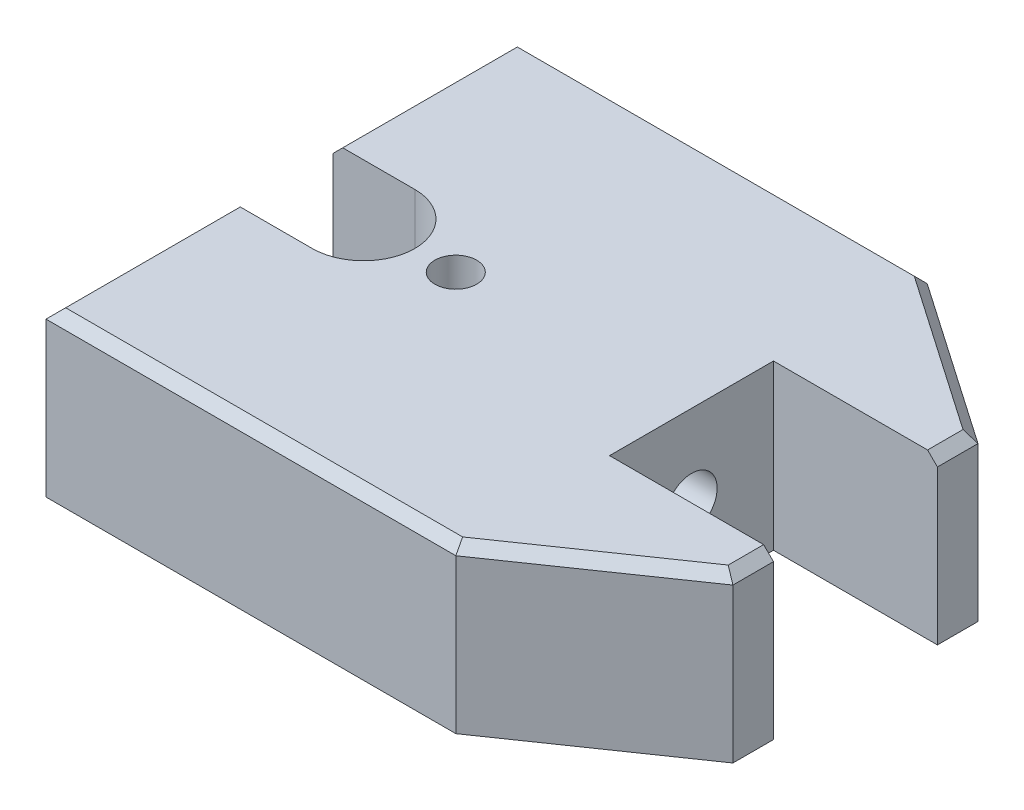
ISO-10303-21;
HEADER;
FILE_DESCRIPTION(('STEP AP214'),'2;1');
FILE_NAME('part.step','',(''),(''),'','','');
FILE_SCHEMA(('AUTOMOTIVE_DESIGN { 1 0 10303 214 1 1 1 1 }'));
ENDSEC;
DATA;
#1=APPLICATION_CONTEXT('core data for automotive mechanical design processes');
#2=APPLICATION_PROTOCOL_DEFINITION('international standard','automotive_design',2000,#1);
#3=PRODUCT_CONTEXT('',#1,'mechanical');
#4=PRODUCT('Part','Part','',(#3));
#5=PRODUCT_RELATED_PRODUCT_CATEGORY('part','',(#4));
#6=PRODUCT_DEFINITION_FORMATION('','',#4);
#7=PRODUCT_DEFINITION_CONTEXT('part definition',#1,'design');
#8=PRODUCT_DEFINITION('design','',#6,#7);
#9=PRODUCT_DEFINITION_SHAPE('','',#8);
#10=(LENGTH_UNIT() NAMED_UNIT(*) SI_UNIT(.MILLI.,.METRE.));
#11=(NAMED_UNIT(*) PLANE_ANGLE_UNIT() SI_UNIT($,.RADIAN.));
#12=(NAMED_UNIT(*) SI_UNIT($,.STERADIAN.) SOLID_ANGLE_UNIT());
#13=UNCERTAINTY_MEASURE_WITH_UNIT(LENGTH_MEASURE(1.E-05),#10,'distance_accuracy_value','');
#14=(GEOMETRIC_REPRESENTATION_CONTEXT(3) GLOBAL_UNCERTAINTY_ASSIGNED_CONTEXT((#13)) GLOBAL_UNIT_ASSIGNED_CONTEXT((#10,
#11,#12)) REPRESENTATION_CONTEXT('',''));
#15=CARTESIAN_POINT('',(0.,0.,0.));
#16=DIRECTION('',(0.,0.,1.));
#17=DIRECTION('',(1.,0.,0.));
#18=AXIS2_PLACEMENT_3D('',#15,#16,#17);
#19=CARTESIAN_POINT('',(0.,12.7,-36.5125));
#20=DIRECTION('',(1.,0.,0.));
#21=DIRECTION('',(0.,0.,-1.));
#22=AXIS2_PLACEMENT_3D('',#19,#20,#21);
#23=PLANE('',#22);
#24=DIRECTION('',(0.,1.,0.));
#25=VECTOR('',#24,1.);
#26=CARTESIAN_POINT('',(0.,-12.7,-7.9375));
#27=LINE('',#26,#25);
#28=CARTESIAN_POINT('',(0.,-12.7,-7.9375));
#29=VERTEX_POINT('',#28);
#30=CARTESIAN_POINT('',(0.,11.176,-7.9375));
#31=VERTEX_POINT('',#30);
#32=EDGE_CURVE('E229',#29,#31,#27,.T.);
#33=ORIENTED_EDGE('',*,*,#32,.T.);
#34=DIRECTION('',(0.,0.,-1.));
#35=VECTOR('',#34,1.);
#36=CARTESIAN_POINT('',(0.,11.176,-36.5125));
#37=LINE('',#36,#35);
#38=CARTESIAN_POINT('',(0.,11.176,-36.5125));
#39=VERTEX_POINT('',#38);
#40=EDGE_CURVE('E318',#31,#39,#37,.T.);
#41=ORIENTED_EDGE('',*,*,#40,.T.);
#42=DIRECTION('',(0.,-1.,0.));
#43=VECTOR('',#42,1.);
#44=CARTESIAN_POINT('',(0.,12.7,-36.5125));
#45=LINE('',#44,#43);
#46=CARTESIAN_POINT('',(0.,-12.7,-36.5125));
#47=VERTEX_POINT('',#46);
#48=EDGE_CURVE('E296',#39,#47,#45,.T.);
#49=ORIENTED_EDGE('',*,*,#48,.T.);
#50=DIRECTION('',(0.,0.,1.));
#51=VECTOR('',#50,1.);
#52=CARTESIAN_POINT('',(0.,-12.7,-36.5125));
#53=LINE('',#52,#51);
#54=EDGE_CURVE('E270',#47,#29,#53,.T.);
#55=ORIENTED_EDGE('',*,*,#54,.T.);
#56=EDGE_LOOP('',(#33,#41,#49,#55));
#57=FACE_BOUND('',#56,.T.);
#58=ADVANCED_FACE('F55',(#57),#23,.F.);
#59=CARTESIAN_POINT('',(88.9,12.7,18.9865));
#60=DIRECTION('',(-1.,0.,0.));
#61=DIRECTION('',(0.,0.,1.));
#62=AXIS2_PLACEMENT_3D('',#59,#60,#61);
#63=PLANE('',#62);
#64=DIRECTION('',(0.,1.,0.));
#65=VECTOR('',#64,1.);
#66=CARTESIAN_POINT('',(88.9,-12.7,12.7));
#67=LINE('',#66,#65);
#68=CARTESIAN_POINT('',(88.9,-12.7,12.7));
#69=VERTEX_POINT('',#68);
#70=CARTESIAN_POINT('',(88.9,11.176,12.7));
#71=VERTEX_POINT('',#70);
#72=EDGE_CURVE('E256',#69,#71,#67,.T.);
#73=ORIENTED_EDGE('',*,*,#72,.T.);
#74=DIRECTION('',(0.,0.,1.));
#75=VECTOR('',#74,1.);
#76=CARTESIAN_POINT('',(88.9,11.176,18.9865));
#77=LINE('',#76,#75);
#78=CARTESIAN_POINT('',(88.9,11.176,18.9865));
#79=VERTEX_POINT('',#78);
#80=EDGE_CURVE('E330',#71,#79,#77,.T.);
#81=ORIENTED_EDGE('',*,*,#80,.T.);
#82=DIRECTION('',(0.,-1.,0.));
#83=VECTOR('',#82,1.);
#84=CARTESIAN_POINT('',(88.9,12.7,18.9865));
#85=LINE('',#84,#83);
#86=CARTESIAN_POINT('',(88.9,-12.7,18.9865));
#87=VERTEX_POINT('',#86);
#88=EDGE_CURVE('E290',#79,#87,#85,.T.);
#89=ORIENTED_EDGE('',*,*,#88,.T.);
#90=DIRECTION('',(0.,0.,-1.));
#91=VECTOR('',#90,1.);
#92=CARTESIAN_POINT('',(88.9,-12.7,18.9865));
#93=LINE('',#92,#91);
#94=EDGE_CURVE('E280',#87,#69,#93,.T.);
#95=ORIENTED_EDGE('',*,*,#94,.T.);
#96=EDGE_LOOP('',(#73,#81,#89,#95));
#97=FACE_BOUND('',#96,.T.);
#98=ADVANCED_FACE('F449',(#97),#63,.F.);
#99=CARTESIAN_POINT('',(0.,12.7,-36.5125));
#100=DIRECTION('',(0.,0.,1.));
#101=DIRECTION('',(1.,0.,0.));
#102=AXIS2_PLACEMENT_3D('',#99,#100,#101);
#103=PLANE('',#102);
#104=ORIENTED_EDGE('',*,*,#48,.F.);
#105=DIRECTION('',(1.,0.,0.));
#106=VECTOR('',#105,1.);
#107=CARTESIAN_POINT('',(63.5,11.176,-36.5125));
#108=LINE('',#107,#106);
#109=CARTESIAN_POINT('',(63.5,11.176,-36.5125));
#110=VERTEX_POINT('',#109);
#111=EDGE_CURVE('E320',#39,#110,#108,.T.);
#112=ORIENTED_EDGE('',*,*,#111,.T.);
#113=DIRECTION('',(0.,-1.,0.));
#114=VECTOR('',#113,1.);
#115=CARTESIAN_POINT('',(63.5,12.7,-36.5125));
#116=LINE('',#115,#114);
#117=CARTESIAN_POINT('',(63.5,-12.7,-36.5125));
#118=VERTEX_POINT('',#117);
#119=EDGE_CURVE('E286',#110,#118,#116,.T.);
#120=ORIENTED_EDGE('',*,*,#119,.T.);
#121=DIRECTION('',(-1.,0.,0.));
#122=VECTOR('',#121,1.);
#123=CARTESIAN_POINT('',(0.,-12.7,-36.5125));
#124=LINE('',#123,#122);
#125=EDGE_CURVE('E259',#118,#47,#124,.T.);
#126=ORIENTED_EDGE('',*,*,#125,.T.);
#127=EDGE_LOOP('',(#104,#112,#120,#126));
#128=FACE_BOUND('',#127,.T.);
#129=ADVANCED_FACE('F427',(#128),#103,.F.);
#130=DIRECTION('',(0.,-1.,0.));
#131=VECTOR('',#130,1.);
#132=CARTESIAN_POINT('',(0.,12.7,36.5125));
#133=LINE('',#132,#131);
#134=CARTESIAN_POINT('',(0.,11.176,36.5125));
#135=VERTEX_POINT('',#134);
#136=CARTESIAN_POINT('',(0.,-12.7,36.5125));
#137=VERTEX_POINT('',#136);
#138=EDGE_CURVE('E294',#135,#137,#133,.T.);
#139=ORIENTED_EDGE('',*,*,#138,.F.);
#140=DIRECTION('',(0.,0.,-1.));
#141=VECTOR('',#140,1.);
#142=CARTESIAN_POINT('',(0.,11.176,7.9375));
#143=LINE('',#142,#141);
#144=CARTESIAN_POINT('',(0.,11.176,7.9375));
#145=VERTEX_POINT('',#144);
#146=EDGE_CURVE('E64',#135,#145,#143,.T.);
#147=ORIENTED_EDGE('',*,*,#146,.T.);
#148=DIRECTION('',(0.,1.,0.));
#149=VECTOR('',#148,1.);
#150=CARTESIAN_POINT('',(0.,-12.7,7.9375));
#151=LINE('',#150,#149);
#152=CARTESIAN_POINT('',(0.,-12.7,7.9375));
#153=VERTEX_POINT('',#152);
#154=EDGE_CURVE('E222',#153,#145,#151,.T.);
#155=ORIENTED_EDGE('',*,*,#154,.F.);
#156=EDGE_CURVE('E269',#153,#137,#53,.T.);
#157=ORIENTED_EDGE('',*,*,#156,.T.);
#158=EDGE_LOOP('',(#139,#147,#155,#157));
#159=FACE_BOUND('',#158,.T.);
#160=ADVANCED_FACE('F377',(#159),#23,.F.);
#161=CARTESIAN_POINT('',(0.,12.7,36.5125));
#162=DIRECTION('',(0.,0.,-1.));
#163=DIRECTION('',(-1.,0.,0.));
#164=AXIS2_PLACEMENT_3D('',#161,#162,#163);
#165=PLANE('',#164);
#166=DIRECTION('',(0.,-1.,0.));
#167=VECTOR('',#166,1.);
#168=CARTESIAN_POINT('',(63.5,12.7,36.5125));
#169=LINE('',#168,#167);
#170=CARTESIAN_POINT('',(63.5,11.176,36.5125));
#171=VERTEX_POINT('',#170);
#172=CARTESIAN_POINT('',(63.5,-12.7,36.5125));
#173=VERTEX_POINT('',#172);
#174=EDGE_CURVE('E292',#171,#173,#169,.T.);
#175=ORIENTED_EDGE('',*,*,#174,.F.);
#176=DIRECTION('',(-1.,0.,0.));
#177=VECTOR('',#176,1.);
#178=CARTESIAN_POINT('',(0.,11.176,36.5125));
#179=LINE('',#178,#177);
#180=EDGE_CURVE('E79',#171,#135,#179,.T.);
#181=ORIENTED_EDGE('',*,*,#180,.T.);
#182=ORIENTED_EDGE('',*,*,#138,.T.);
#183=DIRECTION('',(1.,0.,0.));
#184=VECTOR('',#183,1.);
#185=CARTESIAN_POINT('',(0.,-12.7,36.5125));
#186=LINE('',#185,#184);
#187=EDGE_CURVE('E273',#137,#173,#186,.T.);
#188=ORIENTED_EDGE('',*,*,#187,.T.);
#189=EDGE_LOOP('',(#175,#181,#182,#188));
#190=FACE_BOUND('',#189,.T.);
#191=ADVANCED_FACE('F378',(#190),#165,.F.);
#192=CARTESIAN_POINT('',(63.5,12.7,36.5125));
#193=DIRECTION('',(-0.567925279738124,0.,-0.823080115562497));
#194=DIRECTION('',(-0.823080115562497,0.,0.567925279738124));
#195=AXIS2_PLACEMENT_3D('',#192,#193,#194);
#196=PLANE('',#195);
#197=ORIENTED_EDGE('',*,*,#88,.F.);
#198=DIRECTION('',(-0.823080115562497,0.,0.567925279738124));
#199=VECTOR('',#198,1.);
#200=CARTESIAN_POINT('',(63.5,11.176,36.5125));
#201=LINE('',#200,#199);
#202=EDGE_CURVE('E332',#79,#171,#201,.T.);
#203=ORIENTED_EDGE('',*,*,#202,.T.);
#204=ORIENTED_EDGE('',*,*,#174,.T.);
#205=DIRECTION('',(0.823080115562497,0.,-0.567925279738124));
#206=VECTOR('',#205,1.);
#207=CARTESIAN_POINT('',(63.5,-12.7,36.5125));
#208=LINE('',#207,#206);
#209=EDGE_CURVE('E276',#173,#87,#208,.T.);
#210=ORIENTED_EDGE('',*,*,#209,.T.);
#211=EDGE_LOOP('',(#197,#203,#204,#210));
#212=FACE_BOUND('',#211,.T.);
#213=ADVANCED_FACE('F382',(#212),#196,.F.);
#214=DIRECTION('',(0.,-1.,0.));
#215=VECTOR('',#214,1.);
#216=CARTESIAN_POINT('',(88.9,12.7,-18.9865));
#217=LINE('',#216,#215);
#218=CARTESIAN_POINT('',(88.9,11.176,-18.9865));
#219=VERTEX_POINT('',#218);
#220=CARTESIAN_POINT('',(88.9,-12.7,-18.9865));
#221=VERTEX_POINT('',#220);
#222=EDGE_CURVE('E288',#219,#221,#217,.T.);
#223=ORIENTED_EDGE('',*,*,#222,.F.);
#224=DIRECTION('',(0.,0.,1.));
#225=VECTOR('',#224,1.);
#226=CARTESIAN_POINT('',(88.9,11.176,-12.7));
#227=LINE('',#226,#225);
#228=CARTESIAN_POINT('',(88.9,11.176,-12.7));
#229=VERTEX_POINT('',#228);
#230=EDGE_CURVE('E324',#219,#229,#227,.T.);
#231=ORIENTED_EDGE('',*,*,#230,.T.);
#232=DIRECTION('',(0.,1.,0.));
#233=VECTOR('',#232,1.);
#234=CARTESIAN_POINT('',(88.9,-12.7,-12.7));
#235=LINE('',#234,#233);
#236=CARTESIAN_POINT('',(88.9,-12.7,-12.7));
#237=VERTEX_POINT('',#236);
#238=EDGE_CURVE('E249',#237,#229,#235,.T.);
#239=ORIENTED_EDGE('',*,*,#238,.F.);
#240=EDGE_CURVE('E279',#237,#221,#93,.T.);
#241=ORIENTED_EDGE('',*,*,#240,.T.);
#242=EDGE_LOOP('',(#223,#231,#239,#241));
#243=FACE_BOUND('',#242,.T.);
#244=ADVANCED_FACE('F436',(#243),#63,.F.);
#245=CARTESIAN_POINT('',(63.5,12.7,-36.5125));
#246=DIRECTION('',(-0.567925279738123,0.,0.823080115562498));
#247=DIRECTION('',(0.823080115562498,0.,0.567925279738123));
#248=AXIS2_PLACEMENT_3D('',#245,#246,#247);
#249=PLANE('',#248);
#250=ORIENTED_EDGE('',*,*,#119,.F.);
#251=DIRECTION('',(0.823080115562498,0.,0.567925279738123));
#252=VECTOR('',#251,1.);
#253=CARTESIAN_POINT('',(88.9,11.176,-18.9865));
#254=LINE('',#253,#252);
#255=EDGE_CURVE('E322',#110,#219,#254,.T.);
#256=ORIENTED_EDGE('',*,*,#255,.T.);
#257=ORIENTED_EDGE('',*,*,#222,.T.);
#258=DIRECTION('',(-0.823080115562498,0.,-0.567925279738123));
#259=VECTOR('',#258,1.);
#260=CARTESIAN_POINT('',(63.5,-12.7,-36.5125));
#261=LINE('',#260,#259);
#262=EDGE_CURVE('E283',#221,#118,#261,.T.);
#263=ORIENTED_EDGE('',*,*,#262,.T.);
#264=EDGE_LOOP('',(#250,#256,#257,#263));
#265=FACE_BOUND('',#264,.T.);
#266=ADVANCED_FACE('F430',(#265),#249,.F.);
#267=CARTESIAN_POINT('',(0.,12.7,0.));
#268=DIRECTION('',(0.,1.,0.));
#269=DIRECTION('',(0.,0.,1.));
#270=AXIS2_PLACEMENT_3D('',#267,#268,#269);
#271=PLANE('',#270);
#272=CARTESIAN_POINT('',(26.9748,12.7,0.));
#273=DIRECTION('',(0.,1.,0.));
#274=DIRECTION('',(0.,0.,1.));
#275=AXIS2_PLACEMENT_3D('',#272,#273,#274);
#276=CIRCLE('',#275,3.23850000000001);
#277=CARTESIAN_POINT('',(26.9748,12.7,3.23850000000001));
#278=VERTEX_POINT('',#277);
#279=EDGE_CURVE('E199',#278,#278,#276,.T.);
#280=ORIENTED_EDGE('',*,*,#279,.F.);
#281=EDGE_LOOP('',(#280));
#282=FACE_BOUND('',#281,.T.);
#283=DIRECTION('',(-1.,0.,0.));
#284=VECTOR('',#283,1.);
#285=CARTESIAN_POINT('',(0.,12.7,-34.9885));
#286=LINE('',#285,#284);
#287=CARTESIAN_POINT('',(63.0252440532193,12.7,-34.9885));
#288=VERTEX_POINT('',#287);
#289=CARTESIAN_POINT('',(1.52399999999998,12.7,-34.9885));
#290=VERTEX_POINT('',#289);
#291=EDGE_CURVE('E311',#288,#290,#286,.T.);
#292=ORIENTED_EDGE('',*,*,#291,.T.);
#293=DIRECTION('',(0.,0.,1.));
#294=VECTOR('',#293,1.);
#295=CARTESIAN_POINT('',(1.52399999999999,12.7,-7.9375));
#296=LINE('',#295,#294);
#297=CARTESIAN_POINT('',(1.52399999999999,12.7,-7.9375));
#298=VERTEX_POINT('',#297);
#299=EDGE_CURVE('E313',#290,#298,#296,.T.);
#300=ORIENTED_EDGE('',*,*,#299,.T.);
#301=DIRECTION('',(-1.,0.,0.));
#302=VECTOR('',#301,1.);
#303=CARTESIAN_POINT('',(0.,12.7,-7.9375));
#304=LINE('',#303,#302);
#305=CARTESIAN_POINT('',(12.6873,12.7,-7.9375));
#306=VERTEX_POINT('',#305);
#307=EDGE_CURVE('E216',#306,#298,#304,.T.);
#308=ORIENTED_EDGE('',*,*,#307,.F.);
#309=CARTESIAN_POINT('',(12.6873,12.7,0.));
#310=DIRECTION('',(0.,1.,0.));
#311=DIRECTION('',(0.,0.,-1.));
#312=AXIS2_PLACEMENT_3D('',#309,#310,#311);
#313=CIRCLE('',#312,7.9375);
#314=CARTESIAN_POINT('',(12.6873,12.7,7.9375));
#315=VERTEX_POINT('',#314);
#316=EDGE_CURVE('E224',#315,#306,#313,.T.);
#317=ORIENTED_EDGE('',*,*,#316,.F.);
#318=DIRECTION('',(1.,0.,0.));
#319=VECTOR('',#318,1.);
#320=CARTESIAN_POINT('',(12.6873,12.7,7.9375));
#321=LINE('',#320,#319);
#322=CARTESIAN_POINT('',(1.524,12.7,7.9375));
#323=VERTEX_POINT('',#322);
#324=EDGE_CURVE('E211',#323,#315,#321,.T.);
#325=ORIENTED_EDGE('',*,*,#324,.F.);
#326=DIRECTION('',(0.,0.,1.));
#327=VECTOR('',#326,1.);
#328=CARTESIAN_POINT('',(1.52400000000001,12.7,36.5125));
#329=LINE('',#328,#327);
#330=CARTESIAN_POINT('',(1.52400000000001,12.7,34.9885));
#331=VERTEX_POINT('',#330);
#332=EDGE_CURVE('E298',#323,#331,#329,.T.);
#333=ORIENTED_EDGE('',*,*,#332,.T.);
#334=DIRECTION('',(1.,0.,0.));
#335=VECTOR('',#334,1.);
#336=CARTESIAN_POINT('',(63.5,12.7,34.9885));
#337=LINE('',#336,#335);
#338=CARTESIAN_POINT('',(63.0252440532193,12.7,34.9885));
#339=VERTEX_POINT('',#338);
#340=EDGE_CURVE('E300',#331,#339,#337,.T.);
#341=ORIENTED_EDGE('',*,*,#340,.T.);
#342=DIRECTION('',(0.823080115562497,0.,-0.567925279738124));
#343=VECTOR('',#342,1.);
#344=CARTESIAN_POINT('',(88.0344818736791,12.7,17.7321259038828));
#345=LINE('',#344,#343);
#346=CARTESIAN_POINT('',(87.376,12.7,18.1864783967213));
#347=VERTEX_POINT('',#346);
#348=EDGE_CURVE('E302',#339,#347,#345,.T.);
#349=ORIENTED_EDGE('',*,*,#348,.T.);
#350=DIRECTION('',(0.,0.,-1.));
#351=VECTOR('',#350,1.);
#352=CARTESIAN_POINT('',(87.376,12.7,12.7));
#353=LINE('',#352,#351);
#354=CARTESIAN_POINT('',(87.376,12.7,12.7));
#355=VERTEX_POINT('',#354);
#356=EDGE_CURVE('E304',#347,#355,#353,.T.);
#357=ORIENTED_EDGE('',*,*,#356,.T.);
#358=DIRECTION('',(1.,0.,0.));
#359=VECTOR('',#358,1.);
#360=CARTESIAN_POINT('',(63.5,12.7,12.7));
#361=LINE('',#360,#359);
#362=CARTESIAN_POINT('',(63.5,12.7,12.7));
#363=VERTEX_POINT('',#362);
#364=EDGE_CURVE('E243',#363,#355,#361,.T.);
#365=ORIENTED_EDGE('',*,*,#364,.F.);
#366=DIRECTION('',(0.,0.,1.));
#367=VECTOR('',#366,1.);
#368=CARTESIAN_POINT('',(63.5,12.7,-12.7));
#369=LINE('',#368,#367);
#370=CARTESIAN_POINT('',(63.5,12.7,-12.7));
#371=VERTEX_POINT('',#370);
#372=EDGE_CURVE('E251',#371,#363,#369,.T.);
#373=ORIENTED_EDGE('',*,*,#372,.F.);
#374=DIRECTION('',(-1.,0.,0.));
#375=VECTOR('',#374,1.);
#376=CARTESIAN_POINT('',(63.5,12.7,-12.7));
#377=LINE('',#376,#375);
#378=CARTESIAN_POINT('',(87.376,12.7,-12.7));
#379=VERTEX_POINT('',#378);
#380=EDGE_CURVE('E232',#379,#371,#377,.T.);
#381=ORIENTED_EDGE('',*,*,#380,.F.);
#382=DIRECTION('',(0.,0.,-1.));
#383=VECTOR('',#382,1.);
#384=CARTESIAN_POINT('',(87.376,12.7,-18.9865));
#385=LINE('',#384,#383);
#386=CARTESIAN_POINT('',(87.376,12.7,-18.1864783967214));
#387=VERTEX_POINT('',#386);
#388=EDGE_CURVE('E307',#379,#387,#385,.T.);
#389=ORIENTED_EDGE('',*,*,#388,.T.);
#390=DIRECTION('',(-0.823080115562498,0.,-0.567925279738123));
#391=VECTOR('',#390,1.);
#392=CARTESIAN_POINT('',(62.6344818736791,12.7,-35.2581259038828));
#393=LINE('',#392,#391);
#394=EDGE_CURVE('E309',#387,#288,#393,.T.);
#395=ORIENTED_EDGE('',*,*,#394,.T.);
#396=EDGE_LOOP('',(#292,#300,#308,#317,#325,#333,#341,#349,#357,#365,#373,#381,#389,#395));
#397=FACE_BOUND('',#396,.T.);
#398=ADVANCED_FACE('F366',(#282,#397),#271,.T.);
#399=CARTESIAN_POINT('',(0.,-12.7,0.));
#400=DIRECTION('',(0.,1.,0.));
#401=DIRECTION('',(0.,0.,1.));
#402=AXIS2_PLACEMENT_3D('',#399,#400,#401);
#403=PLANE('',#402);
#404=CARTESIAN_POINT('',(12.6873,-12.7,0.));
#405=DIRECTION('',(0.,1.,0.));
#406=DIRECTION('',(0.,0.,-1.));
#407=AXIS2_PLACEMENT_3D('',#404,#405,#406);
#408=CIRCLE('',#407,7.9375);
#409=CARTESIAN_POINT('',(12.6873,-12.7,7.9375));
#410=VERTEX_POINT('',#409);
#411=CARTESIAN_POINT('',(12.6873,-12.7,-7.9375));
#412=VERTEX_POINT('',#411);
#413=EDGE_CURVE('E215',#410,#412,#408,.T.);
#414=ORIENTED_EDGE('',*,*,#413,.T.);
#415=DIRECTION('',(-1.,0.,0.));
#416=VECTOR('',#415,1.);
#417=CARTESIAN_POINT('',(0.,-12.7,-7.9375));
#418=LINE('',#417,#416);
#419=EDGE_CURVE('E219',#412,#29,#418,.T.);
#420=ORIENTED_EDGE('',*,*,#419,.T.);
#421=ORIENTED_EDGE('',*,*,#54,.F.);
#422=ORIENTED_EDGE('',*,*,#125,.F.);
#423=ORIENTED_EDGE('',*,*,#262,.F.);
#424=ORIENTED_EDGE('',*,*,#240,.F.);
#425=DIRECTION('',(-1.,0.,0.));
#426=VECTOR('',#425,1.);
#427=CARTESIAN_POINT('',(63.5,-12.7,-12.7));
#428=LINE('',#427,#426);
#429=CARTESIAN_POINT('',(63.5,-12.7,-12.7));
#430=VERTEX_POINT('',#429);
#431=EDGE_CURVE('E239',#237,#430,#428,.T.);
#432=ORIENTED_EDGE('',*,*,#431,.T.);
#433=DIRECTION('',(0.,0.,1.));
#434=VECTOR('',#433,1.);
#435=CARTESIAN_POINT('',(63.5,-12.7,-12.7));
#436=LINE('',#435,#434);
#437=CARTESIAN_POINT('',(63.5,-12.7,12.7));
#438=VERTEX_POINT('',#437);
#439=EDGE_CURVE('E242',#430,#438,#436,.T.);
#440=ORIENTED_EDGE('',*,*,#439,.T.);
#441=DIRECTION('',(1.,0.,0.));
#442=VECTOR('',#441,1.);
#443=CARTESIAN_POINT('',(63.5,-12.7,12.7));
#444=LINE('',#443,#442);
#445=EDGE_CURVE('E246',#438,#69,#444,.T.);
#446=ORIENTED_EDGE('',*,*,#445,.T.);
#447=ORIENTED_EDGE('',*,*,#94,.F.);
#448=ORIENTED_EDGE('',*,*,#209,.F.);
#449=ORIENTED_EDGE('',*,*,#187,.F.);
#450=ORIENTED_EDGE('',*,*,#156,.F.);
#451=DIRECTION('',(1.,0.,0.));
#452=VECTOR('',#451,1.);
#453=CARTESIAN_POINT('',(12.6873,-12.7,7.9375));
#454=LINE('',#453,#452);
#455=EDGE_CURVE('E212',#153,#410,#454,.T.);
#456=ORIENTED_EDGE('',*,*,#455,.T.);
#457=EDGE_LOOP('',(#414,#420,#421,#422,#423,#424,#432,#440,#446,#447,#448,#449,#450,#456));
#458=FACE_BOUND('',#457,.T.);
#459=ADVANCED_FACE('F373',(#458),#403,.F.);
#460=CARTESIAN_POINT('',(63.5,-12.7,12.7));
#461=DIRECTION('',(0.,0.,1.));
#462=DIRECTION('',(1.,0.,0.));
#463=AXIS2_PLACEMENT_3D('',#460,#461,#462);
#464=PLANE('',#463);
#465=ORIENTED_EDGE('',*,*,#364,.T.);
#466=DIRECTION('',(0.707106781186548,-0.707106781186548,0.));
#467=VECTOR('',#466,1.);
#468=CARTESIAN_POINT('',(87.376,12.7,12.7));
#469=LINE('',#468,#467);
#470=EDGE_CURVE('E328',#355,#71,#469,.T.);
#471=ORIENTED_EDGE('',*,*,#470,.T.);
#472=ORIENTED_EDGE('',*,*,#72,.F.);
#473=ORIENTED_EDGE('',*,*,#445,.F.);
#474=DIRECTION('',(0.,1.,0.));
#475=VECTOR('',#474,1.);
#476=CARTESIAN_POINT('',(63.5,-12.7,12.7));
#477=LINE('',#476,#475);
#478=EDGE_CURVE('E260',#438,#363,#477,.T.);
#479=ORIENTED_EDGE('',*,*,#478,.T.);
#480=EDGE_LOOP('',(#465,#471,#472,#473,#479));
#481=FACE_BOUND('',#480,.T.);
#482=ADVANCED_FACE('F392',(#481),#464,.F.);
#483=CARTESIAN_POINT('',(63.5,-12.7,-12.7));
#484=DIRECTION('',(-1.,0.,0.));
#485=DIRECTION('',(0.,0.,1.));
#486=AXIS2_PLACEMENT_3D('',#483,#484,#485);
#487=PLANE('',#486);
#488=CARTESIAN_POINT('',(63.5,0.,0.));
#489=DIRECTION('',(1.,0.,0.));
#490=DIRECTION('',(0.,0.,-1.));
#491=AXIS2_PLACEMENT_3D('',#488,#489,#490);
#492=CIRCLE('',#491,3.96875);
#493=CARTESIAN_POINT('',(63.5,0.,-3.96875));
#494=VERTEX_POINT('',#493);
#495=EDGE_CURVE('E200',#494,#494,#492,.T.);
#496=ORIENTED_EDGE('',*,*,#495,.F.);
#497=EDGE_LOOP('',(#496));
#498=FACE_BOUND('',#497,.T.);
#499=ORIENTED_EDGE('',*,*,#372,.T.);
#500=ORIENTED_EDGE('',*,*,#478,.F.);
#501=ORIENTED_EDGE('',*,*,#439,.F.);
#502=DIRECTION('',(0.,1.,0.));
#503=VECTOR('',#502,1.);
#504=CARTESIAN_POINT('',(63.5,-12.7,-12.7));
#505=LINE('',#504,#503);
#506=EDGE_CURVE('E262',#430,#371,#505,.T.);
#507=ORIENTED_EDGE('',*,*,#506,.T.);
#508=EDGE_LOOP('',(#499,#500,#501,#507));
#509=FACE_BOUND('',#508,.T.);
#510=ADVANCED_FACE('F395',(#498,#509),#487,.F.);
#511=CARTESIAN_POINT('',(63.5,-12.7,-12.7));
#512=DIRECTION('',(0.,0.,-1.));
#513=DIRECTION('',(-1.,0.,0.));
#514=AXIS2_PLACEMENT_3D('',#511,#512,#513);
#515=PLANE('',#514);
#516=ORIENTED_EDGE('',*,*,#238,.T.);
#517=DIRECTION('',(-0.707106781186551,0.707106781186544,0.));
#518=VECTOR('',#517,1.);
#519=CARTESIAN_POINT('',(87.376,12.7,-12.7));
#520=LINE('',#519,#518);
#521=EDGE_CURVE('E326',#229,#379,#520,.T.);
#522=ORIENTED_EDGE('',*,*,#521,.T.);
#523=ORIENTED_EDGE('',*,*,#380,.T.);
#524=ORIENTED_EDGE('',*,*,#506,.F.);
#525=ORIENTED_EDGE('',*,*,#431,.F.);
#526=EDGE_LOOP('',(#516,#522,#523,#524,#525));
#527=FACE_BOUND('',#526,.T.);
#528=ADVANCED_FACE('F437',(#527),#515,.F.);
#529=CARTESIAN_POINT('',(0.,-12.7,-7.9375));
#530=DIRECTION('',(0.,0.,-1.));
#531=DIRECTION('',(-1.,0.,0.));
#532=AXIS2_PLACEMENT_3D('',#529,#530,#531);
#533=PLANE('',#532);
#534=ORIENTED_EDGE('',*,*,#307,.T.);
#535=DIRECTION('',(-0.707106781186551,-0.707106781186544,0.));
#536=VECTOR('',#535,1.);
#537=CARTESIAN_POINT('',(1.52399999999999,12.7,-7.9375));
#538=LINE('',#537,#536);
#539=EDGE_CURVE('E316',#298,#31,#538,.T.);
#540=ORIENTED_EDGE('',*,*,#539,.T.);
#541=ORIENTED_EDGE('',*,*,#32,.F.);
#542=ORIENTED_EDGE('',*,*,#419,.F.);
#543=DIRECTION('',(0.,1.,0.));
#544=VECTOR('',#543,1.);
#545=CARTESIAN_POINT('',(12.6873,-12.7,-7.9375));
#546=LINE('',#545,#544);
#547=EDGE_CURVE('E233',#412,#306,#546,.T.);
#548=ORIENTED_EDGE('',*,*,#547,.T.);
#549=EDGE_LOOP('',(#534,#540,#541,#542,#548));
#550=FACE_BOUND('',#549,.T.);
#551=ADVANCED_FACE('F420',(#550),#533,.F.);
#552=CARTESIAN_POINT('',(12.6873,-12.7,0.));
#553=DIRECTION('',(0.,1.,0.));
#554=DIRECTION('',(0.,0.,1.));
#555=AXIS2_PLACEMENT_3D('',#552,#553,#554);
#556=CYLINDRICAL_SURFACE('',#555,7.9375);
#557=ORIENTED_EDGE('',*,*,#316,.T.);
#558=ORIENTED_EDGE('',*,*,#547,.F.);
#559=ORIENTED_EDGE('',*,*,#413,.F.);
#560=DIRECTION('',(0.,1.,0.));
#561=VECTOR('',#560,1.);
#562=CARTESIAN_POINT('',(12.6873,-12.7,7.9375));
#563=LINE('',#562,#561);
#564=EDGE_CURVE('E235',#410,#315,#563,.T.);
#565=ORIENTED_EDGE('',*,*,#564,.T.);
#566=EDGE_LOOP('',(#557,#558,#559,#565));
#567=FACE_BOUND('',#566,.T.);
#568=ADVANCED_FACE('F369',(#567),#556,.F.);
#569=CARTESIAN_POINT('',(12.6873,-12.7,7.9375));
#570=DIRECTION('',(0.,0.,1.));
#571=DIRECTION('',(1.,0.,0.));
#572=AXIS2_PLACEMENT_3D('',#569,#570,#571);
#573=PLANE('',#572);
#574=ORIENTED_EDGE('',*,*,#154,.T.);
#575=DIRECTION('',(0.707106781186548,0.707106781186548,0.));
#576=VECTOR('',#575,1.);
#577=CARTESIAN_POINT('',(1.524,12.7,7.9375));
#578=LINE('',#577,#576);
#579=EDGE_CURVE('E13',#145,#323,#578,.T.);
#580=ORIENTED_EDGE('',*,*,#579,.T.);
#581=ORIENTED_EDGE('',*,*,#324,.T.);
#582=ORIENTED_EDGE('',*,*,#564,.F.);
#583=ORIENTED_EDGE('',*,*,#455,.F.);
#584=EDGE_LOOP('',(#574,#580,#581,#582,#583));
#585=FACE_BOUND('',#584,.T.);
#586=ADVANCED_FACE('F362',(#585),#573,.F.);
#587=CARTESIAN_POINT('',(26.9748,-1.5748,0.));
#588=DIRECTION('',(0.,-1.,0.));
#589=DIRECTION('',(0.,0.,-1.));
#590=AXIS2_PLACEMENT_3D('',#587,#588,#589);
#591=PLANE('',#590);
#592=CARTESIAN_POINT('',(26.9748,-1.5748,0.));
#593=DIRECTION('',(0.,1.,0.));
#594=DIRECTION('',(0.,0.,1.));
#595=AXIS2_PLACEMENT_3D('',#592,#593,#594);
#596=CIRCLE('',#595,3.23850000000001);
#597=CARTESIAN_POINT('',(26.9748,-1.5748,3.23850000000001));
#598=VERTEX_POINT('',#597);
#599=EDGE_CURVE('E203',#598,#598,#596,.T.);
#600=ORIENTED_EDGE('',*,*,#599,.T.);
#601=EDGE_LOOP('',(#600));
#602=FACE_BOUND('',#601,.T.);
#603=ADVANCED_FACE('F518',(#602),#591,.F.);
#604=CARTESIAN_POINT('',(26.9748,12.7,0.));
#605=DIRECTION('',(0.,1.,0.));
#606=DIRECTION('',(0.,0.,1.));
#607=AXIS2_PLACEMENT_3D('',#604,#605,#606);
#608=CYLINDRICAL_SURFACE('',#607,3.23850000000001);
#609=ORIENTED_EDGE('',*,*,#599,.F.);
#610=EDGE_LOOP('',(#609));
#611=FACE_BOUND('',#610,.T.);
#612=ORIENTED_EDGE('',*,*,#279,.T.);
#613=EDGE_LOOP('',(#612));
#614=FACE_BOUND('',#613,.T.);
#615=ADVANCED_FACE('F193',(#611,#614),#608,.F.);
#616=CARTESIAN_POINT('',(43.18,0.,0.));
#617=DIRECTION('',(1.,0.,0.));
#618=DIRECTION('',(0.,0.,-1.));
#619=AXIS2_PLACEMENT_3D('',#616,#617,#618);
#620=CONICAL_SURFACE('',#619,3.96874999999999,1.02974425867665);
#621=CARTESIAN_POINT('',(40.7953344182344,0.,0.));
#622=VERTEX_POINT('',#621);
#623=VERTEX_LOOP('',#622);
#624=FACE_BOUND('',#623,.T.);
#625=CARTESIAN_POINT('',(43.18,0.,0.));
#626=DIRECTION('',(1.,0.,0.));
#627=DIRECTION('',(0.,0.,-1.));
#628=AXIS2_PLACEMENT_3D('',#625,#626,#627);
#629=CIRCLE('',#628,3.96874999999999);
#630=CARTESIAN_POINT('',(43.18,0.,-3.96874999999999));
#631=VERTEX_POINT('',#630);
#632=EDGE_CURVE('E197',#631,#631,#629,.T.);
#633=ORIENTED_EDGE('',*,*,#632,.T.);
#634=EDGE_LOOP('',(#633));
#635=FACE_BOUND('',#634,.T.);
#636=ADVANCED_FACE('F189',(#624,#635),#620,.F.);
#637=CARTESIAN_POINT('',(63.5,0.,0.));
#638=DIRECTION('',(1.,0.,0.));
#639=DIRECTION('',(0.,0.,-1.));
#640=AXIS2_PLACEMENT_3D('',#637,#638,#639);
#641=CYLINDRICAL_SURFACE('',#640,3.96875);
#642=ORIENTED_EDGE('',*,*,#632,.F.);
#643=EDGE_LOOP('',(#642));
#644=FACE_BOUND('',#643,.T.);
#645=ORIENTED_EDGE('',*,*,#495,.T.);
#646=EDGE_LOOP('',(#645));
#647=FACE_BOUND('',#646,.T.);
#648=ADVANCED_FACE('F192',(#644,#647),#641,.F.);
#649=CARTESIAN_POINT('',(87.376,12.7,0.));
#650=DIRECTION('',(0.707106781186544,0.707106781186551,0.));
#651=DIRECTION('',(0.,0.,1.));
#652=AXIS2_PLACEMENT_3D('',#649,#650,#651);
#653=PLANE('',#652);
#654=ORIENTED_EDGE('',*,*,#521,.F.);
#655=ORIENTED_EDGE('',*,*,#230,.F.);
#656=DIRECTION('',(-0.662910359323008,0.662910359323002,0.347993837595564));
#657=VECTOR('',#656,1.);
#658=CARTESIAN_POINT('',(83.1805845787591,16.8954154212409,-15.984101118689));
#659=LINE('',#658,#657);
#660=EDGE_CURVE('E206',#387,#219,#659,.F.);
#661=ORIENTED_EDGE('',*,*,#660,.F.);
#662=ORIENTED_EDGE('',*,*,#388,.F.);
#663=EDGE_LOOP('',(#654,#655,#661,#662));
#664=FACE_BOUND('',#663,.T.);
#665=ADVANCED_FACE('F403',(#664),#653,.T.);
#666=CARTESIAN_POINT('',(36.683411485494,12.7,-53.1643644717305));
#667=DIRECTION('',(0.401583816510091,0.707106781186553,-0.582005531174045));
#668=DIRECTION('',(0.823080115562498,0.,0.567925279738123));
#669=AXIS2_PLACEMENT_3D('',#666,#667,#668);
#670=PLANE('',#669);
#671=ORIENTED_EDGE('',*,*,#660,.T.);
#672=ORIENTED_EDGE('',*,*,#255,.F.);
#673=DIRECTION('',(-0.215120413479633,0.690551666316264,0.690551666316274));
#674=VECTOR('',#673,1.);
#675=CARTESIAN_POINT('',(64.5062851953568,7.94575370582942,-39.7427462941707));
#676=LINE('',#675,#674);
#677=EDGE_CURVE('E339',#288,#110,#676,.F.);
#678=ORIENTED_EDGE('',*,*,#677,.F.);
#679=ORIENTED_EDGE('',*,*,#394,.F.);
#680=EDGE_LOOP('',(#671,#672,#678,#679));
#681=FACE_BOUND('',#680,.T.);
#682=ADVANCED_FACE('F409',(#681),#670,.T.);
#683=CARTESIAN_POINT('',(0.,12.7,-34.9885));
#684=DIRECTION('',(0.,0.707106781186552,-0.707106781186543));
#685=DIRECTION('',(1.,0.,0.));
#686=AXIS2_PLACEMENT_3D('',#683,#684,#685);
#687=PLANE('',#686);
#688=ORIENTED_EDGE('',*,*,#677,.T.);
#689=ORIENTED_EDGE('',*,*,#111,.F.);
#690=DIRECTION('',(0.577350269189627,0.577350269189621,0.577350269189629));
#691=VECTOR('',#690,1.);
#692=CARTESIAN_POINT('',(1.01599999999998,12.192,-35.4965));
#693=LINE('',#692,#691);
#694=EDGE_CURVE('E336',#290,#39,#693,.F.);
#695=ORIENTED_EDGE('',*,*,#694,.F.);
#696=ORIENTED_EDGE('',*,*,#291,.F.);
#697=EDGE_LOOP('',(#688,#689,#695,#696));
#698=FACE_BOUND('',#697,.T.);
#699=ADVANCED_FACE('F415',(#698),#687,.T.);
#700=CARTESIAN_POINT('',(1.52399999999999,12.7,0.));
#701=DIRECTION('',(-0.707106781186544,0.707106781186551,0.));
#702=DIRECTION('',(0.,0.,-1.));
#703=AXIS2_PLACEMENT_3D('',#700,#701,#702);
#704=PLANE('',#703);
#705=ORIENTED_EDGE('',*,*,#694,.T.);
#706=ORIENTED_EDGE('',*,*,#40,.F.);
#707=ORIENTED_EDGE('',*,*,#539,.F.);
#708=ORIENTED_EDGE('',*,*,#299,.F.);
#709=EDGE_LOOP('',(#705,#706,#707,#708));
#710=FACE_BOUND('',#709,.T.);
#711=ADVANCED_FACE('F418',(#710),#704,.T.);
#712=CARTESIAN_POINT('',(1.524,12.7,0.));
#713=DIRECTION('',(-0.707106781186548,0.707106781186548,0.));
#714=DIRECTION('',(0.,0.,-1.));
#715=AXIS2_PLACEMENT_3D('',#712,#713,#714);
#716=PLANE('',#715);
#717=ORIENTED_EDGE('',*,*,#579,.F.);
#718=ORIENTED_EDGE('',*,*,#146,.F.);
#719=DIRECTION('',(0.577350269189627,0.577350269189627,-0.577350269189624));
#720=VECTOR('',#719,1.);
#721=CARTESIAN_POINT('',(13.1868333333333,24.3628333333333,23.3256666666667));
#722=LINE('',#721,#720);
#723=EDGE_CURVE('E59',#331,#135,#722,.F.);
#724=ORIENTED_EDGE('',*,*,#723,.F.);
#725=ORIENTED_EDGE('',*,*,#332,.F.);
#726=EDGE_LOOP('',(#717,#718,#724,#725));
#727=FACE_BOUND('',#726,.T.);
#728=ADVANCED_FACE('F57',(#727),#716,.T.);
#729=CARTESIAN_POINT('',(0.,12.7,34.9885));
#730=DIRECTION('',(0.,0.707106781186546,0.707106781186549));
#731=DIRECTION('',(-1.,0.,0.));
#732=AXIS2_PLACEMENT_3D('',#729,#730,#731);
#733=PLANE('',#732);
#734=ORIENTED_EDGE('',*,*,#723,.T.);
#735=ORIENTED_EDGE('',*,*,#180,.F.);
#736=DIRECTION('',(-0.215120413479627,0.690551666316272,-0.690551666316268));
#737=VECTOR('',#736,1.);
#738=CARTESIAN_POINT('',(60.1086379247861,22.0625109277161,25.625989072284));
#739=LINE('',#738,#737);
#740=EDGE_CURVE('E346',#339,#171,#739,.F.);
#741=ORIENTED_EDGE('',*,*,#740,.F.);
#742=ORIENTED_EDGE('',*,*,#340,.F.);
#743=EDGE_LOOP('',(#734,#735,#741,#742));
#744=FACE_BOUND('',#743,.T.);
#745=ADVANCED_FACE('F356',(#744),#733,.T.);
#746=CARTESIAN_POINT('',(36.6834114854941,12.7,53.1643644717305));
#747=DIRECTION('',(0.401583816510095,0.707106781186546,0.582005531174051));
#748=DIRECTION('',(-0.823080115562497,0.,0.567925279738124));
#749=AXIS2_PLACEMENT_3D('',#746,#747,#748);
#750=PLANE('',#749);
#751=ORIENTED_EDGE('',*,*,#740,.T.);
#752=ORIENTED_EDGE('',*,*,#202,.F.);
#753=DIRECTION('',(-0.662910359323008,0.662910359323008,-0.347993837595553));
#754=VECTOR('',#753,1.);
#755=CARTESIAN_POINT('',(73.1681384165794,26.9078615834206,10.728081937975));
#756=LINE('',#755,#754);
#757=EDGE_CURVE('E344',#347,#79,#756,.F.);
#758=ORIENTED_EDGE('',*,*,#757,.F.);
#759=ORIENTED_EDGE('',*,*,#348,.F.);
#760=EDGE_LOOP('',(#751,#752,#758,#759));
#761=FACE_BOUND('',#760,.T.);
#762=ADVANCED_FACE('F384',(#761),#750,.T.);
#763=CARTESIAN_POINT('',(87.376,12.7,0.));
#764=DIRECTION('',(0.707106781186548,0.707106781186548,0.));
#765=DIRECTION('',(0.,0.,1.));
#766=AXIS2_PLACEMENT_3D('',#763,#764,#765);
#767=PLANE('',#766);
#768=ORIENTED_EDGE('',*,*,#757,.T.);
#769=ORIENTED_EDGE('',*,*,#80,.F.);
#770=ORIENTED_EDGE('',*,*,#470,.F.);
#771=ORIENTED_EDGE('',*,*,#356,.F.);
#772=EDGE_LOOP('',(#768,#769,#770,#771));
#773=FACE_BOUND('',#772,.T.);
#774=ADVANCED_FACE('F388',(#773),#767,.T.);
#775=CLOSED_SHELL('',(#58,#98,#129,#160,#191,#213,#244,#266,#398,#459,#482,#510,#528,#551,#568,
#586,#603,#615,#636,#648,#665,#682,#699,#711,#728,#745,#762,#774));
#776=MANIFOLD_SOLID_BREP('B2',#775);
#777=ADVANCED_BREP_SHAPE_REPRESENTATION('',(#18,#776),#14);
#778=SHAPE_DEFINITION_REPRESENTATION(#9,#777);
ENDSEC;
END-ISO-10303-21;
